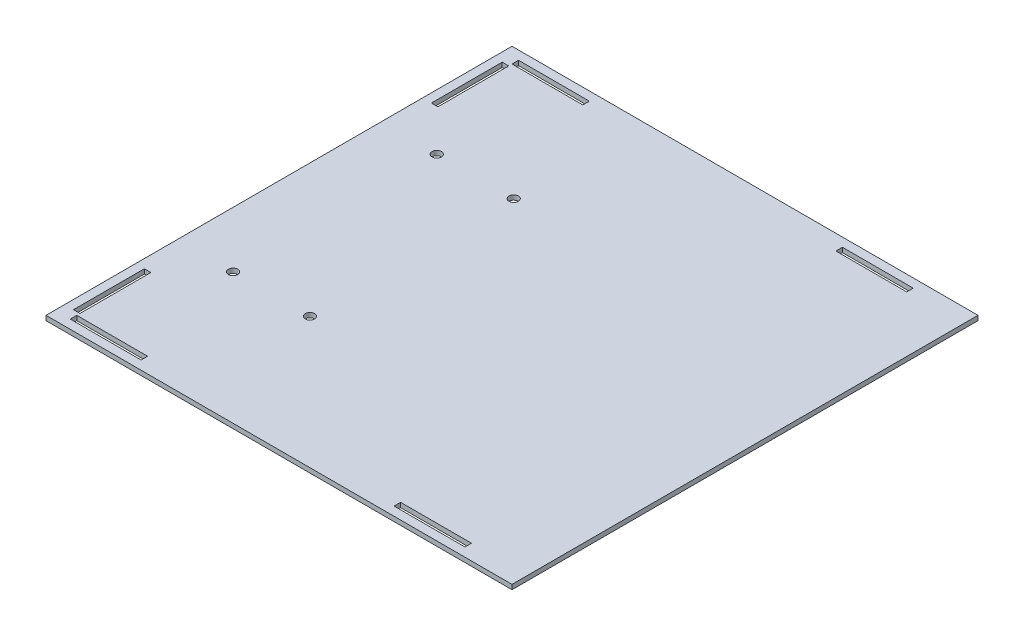
ISO-10303-21;
HEADER;
FILE_DESCRIPTION(('STEP AP214'),'2;1');
FILE_NAME('part.step','',(''),(''),'','','');
FILE_SCHEMA(('AUTOMOTIVE_DESIGN { 1 0 10303 214 1 1 1 1 }'));
ENDSEC;
DATA;
#1=APPLICATION_CONTEXT('core data for automotive mechanical design processes');
#2=APPLICATION_PROTOCOL_DEFINITION('international standard','automotive_design',2000,#1);
#3=PRODUCT_CONTEXT('',#1,'mechanical');
#4=PRODUCT('Part','Part','',(#3));
#5=PRODUCT_RELATED_PRODUCT_CATEGORY('part','',(#4));
#6=PRODUCT_DEFINITION_FORMATION('','',#4);
#7=PRODUCT_DEFINITION_CONTEXT('part definition',#1,'design');
#8=PRODUCT_DEFINITION('design','',#6,#7);
#9=PRODUCT_DEFINITION_SHAPE('','',#8);
#10=(LENGTH_UNIT() NAMED_UNIT(*) SI_UNIT(.MILLI.,.METRE.));
#11=(NAMED_UNIT(*) PLANE_ANGLE_UNIT() SI_UNIT($,.RADIAN.));
#12=(NAMED_UNIT(*) SI_UNIT($,.STERADIAN.) SOLID_ANGLE_UNIT());
#13=UNCERTAINTY_MEASURE_WITH_UNIT(LENGTH_MEASURE(1.E-05),#10,'distance_accuracy_value','');
#14=(GEOMETRIC_REPRESENTATION_CONTEXT(3) GLOBAL_UNCERTAINTY_ASSIGNED_CONTEXT((#13)) GLOBAL_UNIT_ASSIGNED_CONTEXT((#10,
#11,#12)) REPRESENTATION_CONTEXT('',''));
#15=CARTESIAN_POINT('',(0.,0.,0.));
#16=DIRECTION('',(0.,0.,1.));
#17=DIRECTION('',(1.,0.,0.));
#18=AXIS2_PLACEMENT_3D('',#15,#16,#17);
#19=CARTESIAN_POINT('',(0.,2.54,0.));
#20=DIRECTION('',(0.,1.,0.));
#21=DIRECTION('',(0.,0.,1.));
#22=AXIS2_PLACEMENT_3D('',#19,#20,#21);
#23=PLANE('',#22);
#24=CARTESIAN_POINT('',(30.48,2.54,119.0244));
#25=DIRECTION('',(0.,1.,0.));
#26=DIRECTION('',(0.,0.,1.));
#27=AXIS2_PLACEMENT_3D('',#24,#25,#26);
#28=CIRCLE('',#27,2.55269999999999);
#29=CARTESIAN_POINT('',(30.48,2.54,121.5771));
#30=VERTEX_POINT('',#29);
#31=EDGE_CURVE('E603',#30,#30,#28,.T.);
#32=ORIENTED_EDGE('',*,*,#31,.F.);
#33=EDGE_LOOP('',(#32));
#34=FACE_BOUND('',#33,.T.);
#35=CARTESIAN_POINT('',(72.39,2.54,119.0244));
#36=DIRECTION('',(0.,1.,0.));
#37=DIRECTION('',(0.,0.,1.));
#38=AXIS2_PLACEMENT_3D('',#35,#36,#37);
#39=CIRCLE('',#38,2.55269999999999);
#40=CARTESIAN_POINT('',(72.39,2.54,121.5771));
#41=VERTEX_POINT('',#40);
#42=EDGE_CURVE('E605',#41,#41,#39,.T.);
#43=ORIENTED_EDGE('',*,*,#42,.F.);
#44=EDGE_LOOP('',(#43));
#45=FACE_BOUND('',#44,.T.);
#46=CARTESIAN_POINT('',(30.48,2.54,7.9756));
#47=DIRECTION('',(0.,1.,0.));
#48=DIRECTION('',(0.,0.,1.));
#49=AXIS2_PLACEMENT_3D('',#46,#47,#48);
#50=CIRCLE('',#49,2.55269999999999);
#51=CARTESIAN_POINT('',(30.48,2.54,10.5283));
#52=VERTEX_POINT('',#51);
#53=EDGE_CURVE('E339',#52,#52,#50,.T.);
#54=ORIENTED_EDGE('',*,*,#53,.F.);
#55=EDGE_LOOP('',(#54));
#56=FACE_BOUND('',#55,.T.);
#57=CARTESIAN_POINT('',(72.39,2.54,7.9756));
#58=DIRECTION('',(0.,1.,0.));
#59=DIRECTION('',(0.,0.,1.));
#60=AXIS2_PLACEMENT_3D('',#57,#58,#59);
#61=CIRCLE('',#60,2.55269999999999);
#62=CARTESIAN_POINT('',(72.39,2.54,10.5283));
#63=VERTEX_POINT('',#62);
#64=EDGE_CURVE('E345',#63,#63,#61,.T.);
#65=ORIENTED_EDGE('',*,*,#64,.F.);
#66=EDGE_LOOP('',(#65));
#67=FACE_BOUND('',#66,.T.);
#68=DIRECTION('',(0.,0.,1.));
#69=VECTOR('',#68,1.);
#70=CARTESIAN_POINT('',(0.,2.54,-63.5));
#71=LINE('',#70,#69);
#72=CARTESIAN_POINT('',(0.,2.54,-63.5));
#73=VERTEX_POINT('',#72);
#74=CARTESIAN_POINT('',(0.,2.54,190.5));
#75=VERTEX_POINT('',#74);
#76=EDGE_CURVE('E439',#73,#75,#71,.T.);
#77=ORIENTED_EDGE('',*,*,#76,.T.);
#78=DIRECTION('',(-1.,0.,0.));
#79=VECTOR('',#78,1.);
#80=CARTESIAN_POINT('',(0.,2.54,190.5));
#81=LINE('',#80,#79);
#82=CARTESIAN_POINT('',(254.,2.54,190.5));
#83=VERTEX_POINT('',#82);
#84=EDGE_CURVE('E328',#83,#75,#81,.T.);
#85=ORIENTED_EDGE('',*,*,#84,.F.);
#86=DIRECTION('',(0.,0.,-1.));
#87=VECTOR('',#86,1.);
#88=CARTESIAN_POINT('',(254.,2.54,-63.5));
#89=LINE('',#88,#87);
#90=CARTESIAN_POINT('',(254.,2.54,-63.5));
#91=VERTEX_POINT('',#90);
#92=EDGE_CURVE('E441',#83,#91,#89,.T.);
#93=ORIENTED_EDGE('',*,*,#92,.T.);
#94=DIRECTION('',(-1.,0.,0.));
#95=VECTOR('',#94,1.);
#96=CARTESIAN_POINT('',(0.,2.54,-63.5));
#97=LINE('',#96,#95);
#98=EDGE_CURVE('E444',#91,#73,#97,.T.);
#99=ORIENTED_EDGE('',*,*,#98,.T.);
#100=EDGE_LOOP('',(#77,#85,#93,#99));
#101=FACE_BOUND('',#100,.T.);
#102=DIRECTION('',(1.,0.,0.));
#103=VECTOR('',#102,1.);
#104=CARTESIAN_POINT('',(8.382,2.54,-55.118));
#105=LINE('',#104,#103);
#106=CARTESIAN_POINT('',(8.382,2.54,-55.118));
#107=VERTEX_POINT('',#106);
#108=CARTESIAN_POINT('',(46.99,2.54,-55.118));
#109=VERTEX_POINT('',#108);
#110=EDGE_CURVE('E410',#107,#109,#105,.T.);
#111=ORIENTED_EDGE('',*,*,#110,.F.);
#112=DIRECTION('',(0.,0.,1.));
#113=VECTOR('',#112,1.);
#114=CARTESIAN_POINT('',(8.38199999999999,2.54,-58.674));
#115=LINE('',#114,#113);
#116=CARTESIAN_POINT('',(8.38199999999999,2.54,-58.674));
#117=VERTEX_POINT('',#116);
#118=EDGE_CURVE('E408',#117,#107,#115,.T.);
#119=ORIENTED_EDGE('',*,*,#118,.F.);
#120=DIRECTION('',(-1.,0.,0.));
#121=VECTOR('',#120,1.);
#122=CARTESIAN_POINT('',(8.38199999999999,2.54,-58.674));
#123=LINE('',#122,#121);
#124=CARTESIAN_POINT('',(46.99,2.54,-58.674));
#125=VERTEX_POINT('',#124);
#126=EDGE_CURVE('E416',#125,#117,#123,.T.);
#127=ORIENTED_EDGE('',*,*,#126,.F.);
#128=DIRECTION('',(0.,0.,-1.));
#129=VECTOR('',#128,1.);
#130=CARTESIAN_POINT('',(46.99,2.54,-58.674));
#131=LINE('',#130,#129);
#132=EDGE_CURVE('E413',#109,#125,#131,.T.);
#133=ORIENTED_EDGE('',*,*,#132,.F.);
#134=EDGE_LOOP('',(#111,#119,#127,#133));
#135=FACE_BOUND('',#134,.T.);
#136=DIRECTION('',(1.,0.,0.));
#137=VECTOR('',#136,1.);
#138=CARTESIAN_POINT('',(184.912,2.54,-55.118));
#139=LINE('',#138,#137);
#140=CARTESIAN_POINT('',(184.912,2.54,-55.118));
#141=VERTEX_POINT('',#140);
#142=CARTESIAN_POINT('',(223.52,2.54,-55.118));
#143=VERTEX_POINT('',#142);
#144=EDGE_CURVE('E379',#141,#143,#139,.T.);
#145=ORIENTED_EDGE('',*,*,#144,.F.);
#146=DIRECTION('',(0.,0.,1.));
#147=VECTOR('',#146,1.);
#148=CARTESIAN_POINT('',(184.912,2.54,-58.6740000000002));
#149=LINE('',#148,#147);
#150=CARTESIAN_POINT('',(184.912,2.54,-58.6740000000002));
#151=VERTEX_POINT('',#150);
#152=EDGE_CURVE('E377',#151,#141,#149,.T.);
#153=ORIENTED_EDGE('',*,*,#152,.F.);
#154=DIRECTION('',(-1.,0.,0.));
#155=VECTOR('',#154,1.);
#156=CARTESIAN_POINT('',(184.912,2.54,-58.6740000000002));
#157=LINE('',#156,#155);
#158=CARTESIAN_POINT('',(223.52,2.54,-58.6740000000002));
#159=VERTEX_POINT('',#158);
#160=EDGE_CURVE('E385',#159,#151,#157,.T.);
#161=ORIENTED_EDGE('',*,*,#160,.F.);
#162=DIRECTION('',(0.,0.,-1.));
#163=VECTOR('',#162,1.);
#164=CARTESIAN_POINT('',(223.52,2.54,-58.6740000000002));
#165=LINE('',#164,#163);
#166=EDGE_CURVE('E382',#143,#159,#165,.T.);
#167=ORIENTED_EDGE('',*,*,#166,.F.);
#168=EDGE_LOOP('',(#145,#153,#161,#167));
#169=FACE_BOUND('',#168,.T.);
#170=DIRECTION('',(1.,0.,0.));
#171=VECTOR('',#170,1.);
#172=CARTESIAN_POINT('',(4.82599999999999,2.54,-14.732));
#173=LINE('',#172,#171);
#174=CARTESIAN_POINT('',(4.82599999999999,2.54,-14.732));
#175=VERTEX_POINT('',#174);
#176=CARTESIAN_POINT('',(8.38199999999999,2.54,-14.732));
#177=VERTEX_POINT('',#176);
#178=EDGE_CURVE('E353',#175,#177,#173,.T.);
#179=ORIENTED_EDGE('',*,*,#178,.F.);
#180=DIRECTION('',(0.,0.,1.));
#181=VECTOR('',#180,1.);
#182=CARTESIAN_POINT('',(4.82599999999998,2.54,-53.34));
#183=LINE('',#182,#181);
#184=CARTESIAN_POINT('',(4.82599999999998,2.54,-53.34));
#185=VERTEX_POINT('',#184);
#186=EDGE_CURVE('E351',#185,#175,#183,.T.);
#187=ORIENTED_EDGE('',*,*,#186,.F.);
#188=DIRECTION('',(-1.,0.,0.));
#189=VECTOR('',#188,1.);
#190=CARTESIAN_POINT('',(4.82599999999998,2.54,-53.34));
#191=LINE('',#190,#189);
#192=CARTESIAN_POINT('',(8.38199999999998,2.54,-53.34));
#193=VERTEX_POINT('',#192);
#194=EDGE_CURVE('E358',#193,#185,#191,.T.);
#195=ORIENTED_EDGE('',*,*,#194,.F.);
#196=DIRECTION('',(0.,0.,-1.));
#197=VECTOR('',#196,1.);
#198=CARTESIAN_POINT('',(8.38199999999998,2.54,-53.34));
#199=LINE('',#198,#197);
#200=EDGE_CURVE('E356',#177,#193,#199,.T.);
#201=ORIENTED_EDGE('',*,*,#200,.F.);
#202=EDGE_LOOP('',(#179,#187,#195,#201));
#203=FACE_BOUND('',#202,.T.);
#204=DIRECTION('',(0.,0.,-1.));
#205=VECTOR('',#204,1.);
#206=CARTESIAN_POINT('',(4.82599999999998,2.54,180.34));
#207=LINE('',#206,#205);
#208=CARTESIAN_POINT('',(4.82599999999998,2.54,180.34));
#209=VERTEX_POINT('',#208);
#210=CARTESIAN_POINT('',(4.82599999999999,2.54,141.732));
#211=VERTEX_POINT('',#210);
#212=EDGE_CURVE('E234',#209,#211,#207,.T.);
#213=ORIENTED_EDGE('',*,*,#212,.T.);
#214=DIRECTION('',(1.,0.,0.));
#215=VECTOR('',#214,1.);
#216=CARTESIAN_POINT('',(4.82599999999999,2.54,141.732));
#217=LINE('',#216,#215);
#218=CARTESIAN_POINT('',(8.38199999999999,2.54,141.732));
#219=VERTEX_POINT('',#218);
#220=EDGE_CURVE('E246',#211,#219,#217,.T.);
#221=ORIENTED_EDGE('',*,*,#220,.T.);
#222=DIRECTION('',(0.,0.,1.));
#223=VECTOR('',#222,1.);
#224=CARTESIAN_POINT('',(8.38199999999998,2.54,180.34));
#225=LINE('',#224,#223);
#226=CARTESIAN_POINT('',(8.38199999999998,2.54,180.34));
#227=VERTEX_POINT('',#226);
#228=EDGE_CURVE('E244',#219,#227,#225,.T.);
#229=ORIENTED_EDGE('',*,*,#228,.T.);
#230=DIRECTION('',(-1.,0.,0.));
#231=VECTOR('',#230,1.);
#232=CARTESIAN_POINT('',(4.82599999999998,2.54,180.34));
#233=LINE('',#232,#231);
#234=EDGE_CURVE('E224',#227,#209,#233,.T.);
#235=ORIENTED_EDGE('',*,*,#234,.T.);
#236=EDGE_LOOP('',(#213,#221,#229,#235));
#237=FACE_BOUND('',#236,.T.);
#238=DIRECTION('',(0.,0.,-1.));
#239=VECTOR('',#238,1.);
#240=CARTESIAN_POINT('',(184.912,2.54,185.674));
#241=LINE('',#240,#239);
#242=CARTESIAN_POINT('',(184.912,2.54,185.674));
#243=VERTEX_POINT('',#242);
#244=CARTESIAN_POINT('',(184.912,2.54,182.118));
#245=VERTEX_POINT('',#244);
#246=EDGE_CURVE('E264',#243,#245,#241,.T.);
#247=ORIENTED_EDGE('',*,*,#246,.T.);
#248=DIRECTION('',(1.,0.,0.));
#249=VECTOR('',#248,1.);
#250=CARTESIAN_POINT('',(184.912,2.54,182.118));
#251=LINE('',#250,#249);
#252=CARTESIAN_POINT('',(223.52,2.54,182.118));
#253=VERTEX_POINT('',#252);
#254=EDGE_CURVE('E274',#245,#253,#251,.T.);
#255=ORIENTED_EDGE('',*,*,#254,.T.);
#256=DIRECTION('',(0.,0.,1.));
#257=VECTOR('',#256,1.);
#258=CARTESIAN_POINT('',(223.52,2.54,185.674));
#259=LINE('',#258,#257);
#260=CARTESIAN_POINT('',(223.52,2.54,185.674));
#261=VERTEX_POINT('',#260);
#262=EDGE_CURVE('E271',#253,#261,#259,.T.);
#263=ORIENTED_EDGE('',*,*,#262,.T.);
#264=DIRECTION('',(-1.,0.,0.));
#265=VECTOR('',#264,1.);
#266=CARTESIAN_POINT('',(184.912,2.54,185.674));
#267=LINE('',#266,#265);
#268=EDGE_CURVE('E267',#261,#243,#267,.T.);
#269=ORIENTED_EDGE('',*,*,#268,.T.);
#270=EDGE_LOOP('',(#247,#255,#263,#269));
#271=FACE_BOUND('',#270,.T.);
#272=DIRECTION('',(0.,0.,-1.));
#273=VECTOR('',#272,1.);
#274=CARTESIAN_POINT('',(8.38199999999999,2.54,185.674));
#275=LINE('',#274,#273);
#276=CARTESIAN_POINT('',(8.38199999999999,2.54,185.674));
#277=VERTEX_POINT('',#276);
#278=CARTESIAN_POINT('',(8.382,2.54,182.118));
#279=VERTEX_POINT('',#278);
#280=EDGE_CURVE('E296',#277,#279,#275,.T.);
#281=ORIENTED_EDGE('',*,*,#280,.T.);
#282=DIRECTION('',(1.,0.,0.));
#283=VECTOR('',#282,1.);
#284=CARTESIAN_POINT('',(8.382,2.54,182.118));
#285=LINE('',#284,#283);
#286=CARTESIAN_POINT('',(46.99,2.54,182.118));
#287=VERTEX_POINT('',#286);
#288=EDGE_CURVE('E306',#279,#287,#285,.T.);
#289=ORIENTED_EDGE('',*,*,#288,.T.);
#290=DIRECTION('',(0.,0.,1.));
#291=VECTOR('',#290,1.);
#292=CARTESIAN_POINT('',(46.99,2.54,185.674));
#293=LINE('',#292,#291);
#294=CARTESIAN_POINT('',(46.99,2.54,185.674));
#295=VERTEX_POINT('',#294);
#296=EDGE_CURVE('E303',#287,#295,#293,.T.);
#297=ORIENTED_EDGE('',*,*,#296,.T.);
#298=DIRECTION('',(-1.,0.,0.));
#299=VECTOR('',#298,1.);
#300=CARTESIAN_POINT('',(8.38199999999999,2.54,185.674));
#301=LINE('',#300,#299);
#302=EDGE_CURVE('E299',#295,#277,#301,.T.);
#303=ORIENTED_EDGE('',*,*,#302,.T.);
#304=EDGE_LOOP('',(#281,#289,#297,#303));
#305=FACE_BOUND('',#304,.T.);
#306=ADVANCED_FACE('F33',(#34,#45,#56,#67,#101,#135,#169,#203,#237,#271,#305),#23,.T.);
#307=CARTESIAN_POINT('',(0.,0.,0.));
#308=DIRECTION('',(0.,1.,0.));
#309=DIRECTION('',(0.,0.,1.));
#310=AXIS2_PLACEMENT_3D('',#307,#308,#309);
#311=PLANE('',#310);
#312=CARTESIAN_POINT('',(30.48,0.,119.0244));
#313=DIRECTION('',(0.,1.,0.));
#314=DIRECTION('',(0.,0.,1.));
#315=AXIS2_PLACEMENT_3D('',#312,#313,#314);
#316=CIRCLE('',#315,2.55269999999999);
#317=CARTESIAN_POINT('',(30.48,0.,121.5771));
#318=VERTEX_POINT('',#317);
#319=EDGE_CURVE('E601',#318,#318,#316,.T.);
#320=ORIENTED_EDGE('',*,*,#319,.T.);
#321=EDGE_LOOP('',(#320));
#322=FACE_BOUND('',#321,.T.);
#323=CARTESIAN_POINT('',(72.39,0.,119.0244));
#324=DIRECTION('',(0.,1.,0.));
#325=DIRECTION('',(0.,0.,1.));
#326=AXIS2_PLACEMENT_3D('',#323,#324,#325);
#327=CIRCLE('',#326,2.55269999999999);
#328=CARTESIAN_POINT('',(72.39,0.,121.5771));
#329=VERTEX_POINT('',#328);
#330=EDGE_CURVE('E253',#329,#329,#327,.T.);
#331=ORIENTED_EDGE('',*,*,#330,.T.);
#332=EDGE_LOOP('',(#331));
#333=FACE_BOUND('',#332,.T.);
#334=CARTESIAN_POINT('',(30.48,0.,7.9756));
#335=DIRECTION('',(0.,1.,0.));
#336=DIRECTION('',(0.,0.,1.));
#337=AXIS2_PLACEMENT_3D('',#334,#335,#336);
#338=CIRCLE('',#337,2.55269999999999);
#339=CARTESIAN_POINT('',(30.48,0.,10.5283));
#340=VERTEX_POINT('',#339);
#341=EDGE_CURVE('E342',#340,#340,#338,.T.);
#342=ORIENTED_EDGE('',*,*,#341,.T.);
#343=EDGE_LOOP('',(#342));
#344=FACE_BOUND('',#343,.T.);
#345=CARTESIAN_POINT('',(72.39,0.,7.9756));
#346=DIRECTION('',(0.,1.,0.));
#347=DIRECTION('',(0.,0.,1.));
#348=AXIS2_PLACEMENT_3D('',#345,#346,#347);
#349=CIRCLE('',#348,2.55269999999999);
#350=CARTESIAN_POINT('',(72.39,0.,10.5283));
#351=VERTEX_POINT('',#350);
#352=EDGE_CURVE('E348',#351,#351,#349,.T.);
#353=ORIENTED_EDGE('',*,*,#352,.T.);
#354=EDGE_LOOP('',(#353));
#355=FACE_BOUND('',#354,.T.);
#356=DIRECTION('',(0.,0.,1.));
#357=VECTOR('',#356,1.);
#358=CARTESIAN_POINT('',(184.912,0.,-58.6740000000002));
#359=LINE('',#358,#357);
#360=CARTESIAN_POINT('',(184.912,0.,-58.6740000000002));
#361=VERTEX_POINT('',#360);
#362=CARTESIAN_POINT('',(184.912,0.,-55.118));
#363=VERTEX_POINT('',#362);
#364=EDGE_CURVE('E376',#361,#363,#359,.T.);
#365=ORIENTED_EDGE('',*,*,#364,.T.);
#366=DIRECTION('',(1.,0.,0.));
#367=VECTOR('',#366,1.);
#368=CARTESIAN_POINT('',(184.912,0.,-55.118));
#369=LINE('',#368,#367);
#370=CARTESIAN_POINT('',(223.52,0.,-55.118));
#371=VERTEX_POINT('',#370);
#372=EDGE_CURVE('E390',#363,#371,#369,.T.);
#373=ORIENTED_EDGE('',*,*,#372,.T.);
#374=DIRECTION('',(0.,0.,-1.));
#375=VECTOR('',#374,1.);
#376=CARTESIAN_POINT('',(223.52,0.,-58.6740000000002));
#377=LINE('',#376,#375);
#378=CARTESIAN_POINT('',(223.52,0.,-58.6740000000002));
#379=VERTEX_POINT('',#378);
#380=EDGE_CURVE('E393',#371,#379,#377,.T.);
#381=ORIENTED_EDGE('',*,*,#380,.T.);
#382=DIRECTION('',(-1.,0.,0.));
#383=VECTOR('',#382,1.);
#384=CARTESIAN_POINT('',(184.912,0.,-58.6740000000002));
#385=LINE('',#384,#383);
#386=EDGE_CURVE('E380',#379,#361,#385,.T.);
#387=ORIENTED_EDGE('',*,*,#386,.T.);
#388=EDGE_LOOP('',(#365,#373,#381,#387));
#389=FACE_BOUND('',#388,.T.);
#390=DIRECTION('',(0.,0.,1.));
#391=VECTOR('',#390,1.);
#392=CARTESIAN_POINT('',(0.,0.,-63.5));
#393=LINE('',#392,#391);
#394=CARTESIAN_POINT('',(0.,0.,-63.5));
#395=VERTEX_POINT('',#394);
#396=CARTESIAN_POINT('',(0.,0.,190.5));
#397=VERTEX_POINT('',#396);
#398=EDGE_CURVE('E438',#395,#397,#393,.T.);
#399=ORIENTED_EDGE('',*,*,#398,.F.);
#400=DIRECTION('',(-1.,0.,0.));
#401=VECTOR('',#400,1.);
#402=CARTESIAN_POINT('',(0.,0.,-63.5));
#403=LINE('',#402,#401);
#404=CARTESIAN_POINT('',(254.,0.,-63.5));
#405=VERTEX_POINT('',#404);
#406=EDGE_CURVE('E442',#405,#395,#403,.T.);
#407=ORIENTED_EDGE('',*,*,#406,.F.);
#408=DIRECTION('',(0.,0.,-1.));
#409=VECTOR('',#408,1.);
#410=CARTESIAN_POINT('',(254.,0.,-63.5));
#411=LINE('',#410,#409);
#412=CARTESIAN_POINT('',(254.,0.,190.5));
#413=VERTEX_POINT('',#412);
#414=EDGE_CURVE('E447',#413,#405,#411,.T.);
#415=ORIENTED_EDGE('',*,*,#414,.F.);
#416=DIRECTION('',(-1.,0.,0.));
#417=VECTOR('',#416,1.);
#418=CARTESIAN_POINT('',(0.,0.,190.5));
#419=LINE('',#418,#417);
#420=EDGE_CURVE('E327',#413,#397,#419,.T.);
#421=ORIENTED_EDGE('',*,*,#420,.T.);
#422=EDGE_LOOP('',(#399,#407,#415,#421));
#423=FACE_BOUND('',#422,.T.);
#424=DIRECTION('',(0.,0.,1.));
#425=VECTOR('',#424,1.);
#426=CARTESIAN_POINT('',(8.38199999999999,0.,-58.674));
#427=LINE('',#426,#425);
#428=CARTESIAN_POINT('',(8.38199999999999,0.,-58.674));
#429=VERTEX_POINT('',#428);
#430=CARTESIAN_POINT('',(8.382,0.,-55.118));
#431=VERTEX_POINT('',#430);
#432=EDGE_CURVE('E407',#429,#431,#427,.T.);
#433=ORIENTED_EDGE('',*,*,#432,.T.);
#434=DIRECTION('',(1.,0.,0.));
#435=VECTOR('',#434,1.);
#436=CARTESIAN_POINT('',(8.382,0.,-55.118));
#437=LINE('',#436,#435);
#438=CARTESIAN_POINT('',(46.99,0.,-55.118));
#439=VERTEX_POINT('',#438);
#440=EDGE_CURVE('E421',#431,#439,#437,.T.);
#441=ORIENTED_EDGE('',*,*,#440,.T.);
#442=DIRECTION('',(0.,0.,-1.));
#443=VECTOR('',#442,1.);
#444=CARTESIAN_POINT('',(46.99,0.,-58.674));
#445=LINE('',#444,#443);
#446=CARTESIAN_POINT('',(46.99,0.,-58.674));
#447=VERTEX_POINT('',#446);
#448=EDGE_CURVE('E424',#439,#447,#445,.T.);
#449=ORIENTED_EDGE('',*,*,#448,.T.);
#450=DIRECTION('',(-1.,0.,0.));
#451=VECTOR('',#450,1.);
#452=CARTESIAN_POINT('',(8.38199999999999,0.,-58.674));
#453=LINE('',#452,#451);
#454=EDGE_CURVE('E411',#447,#429,#453,.T.);
#455=ORIENTED_EDGE('',*,*,#454,.T.);
#456=EDGE_LOOP('',(#433,#441,#449,#455));
#457=FACE_BOUND('',#456,.T.);
#458=DIRECTION('',(0.,0.,1.));
#459=VECTOR('',#458,1.);
#460=CARTESIAN_POINT('',(4.82599999999998,0.,-53.34));
#461=LINE('',#460,#459);
#462=CARTESIAN_POINT('',(4.82599999999998,0.,-53.34));
#463=VERTEX_POINT('',#462);
#464=CARTESIAN_POINT('',(4.82599999999999,0.,-14.732));
#465=VERTEX_POINT('',#464);
#466=EDGE_CURVE('E56',#463,#465,#461,.T.);
#467=ORIENTED_EDGE('',*,*,#466,.T.);
#468=DIRECTION('',(1.,0.,0.));
#469=VECTOR('',#468,1.);
#470=CARTESIAN_POINT('',(4.82599999999999,0.,-14.732));
#471=LINE('',#470,#469);
#472=CARTESIAN_POINT('',(8.38199999999999,0.,-14.732));
#473=VERTEX_POINT('',#472);
#474=EDGE_CURVE('E362',#465,#473,#471,.T.);
#475=ORIENTED_EDGE('',*,*,#474,.T.);
#476=DIRECTION('',(0.,0.,-1.));
#477=VECTOR('',#476,1.);
#478=CARTESIAN_POINT('',(8.38199999999998,0.,-53.34));
#479=LINE('',#478,#477);
#480=CARTESIAN_POINT('',(8.38199999999998,0.,-53.34));
#481=VERTEX_POINT('',#480);
#482=EDGE_CURVE('E365',#473,#481,#479,.T.);
#483=ORIENTED_EDGE('',*,*,#482,.T.);
#484=DIRECTION('',(-1.,0.,0.));
#485=VECTOR('',#484,1.);
#486=CARTESIAN_POINT('',(4.82599999999998,0.,-53.34));
#487=LINE('',#486,#485);
#488=EDGE_CURVE('E354',#481,#463,#487,.T.);
#489=ORIENTED_EDGE('',*,*,#488,.T.);
#490=EDGE_LOOP('',(#467,#475,#483,#489));
#491=FACE_BOUND('',#490,.T.);
#492=DIRECTION('',(1.,0.,0.));
#493=VECTOR('',#492,1.);
#494=CARTESIAN_POINT('',(4.82599999999999,0.,141.732));
#495=LINE('',#494,#493);
#496=CARTESIAN_POINT('',(4.82599999999999,0.,141.732));
#497=VERTEX_POINT('',#496);
#498=CARTESIAN_POINT('',(8.38199999999999,0.,141.732));
#499=VERTEX_POINT('',#498);
#500=EDGE_CURVE('E241',#497,#499,#495,.T.);
#501=ORIENTED_EDGE('',*,*,#500,.F.);
#502=DIRECTION('',(0.,0.,-1.));
#503=VECTOR('',#502,1.);
#504=CARTESIAN_POINT('',(4.82599999999998,0.,180.34));
#505=LINE('',#504,#503);
#506=CARTESIAN_POINT('',(4.82599999999998,0.,180.34));
#507=VERTEX_POINT('',#506);
#508=EDGE_CURVE('E251',#507,#497,#505,.T.);
#509=ORIENTED_EDGE('',*,*,#508,.F.);
#510=DIRECTION('',(-1.,0.,0.));
#511=VECTOR('',#510,1.);
#512=CARTESIAN_POINT('',(4.82599999999998,0.,180.34));
#513=LINE('',#512,#511);
#514=CARTESIAN_POINT('',(8.38199999999998,0.,180.34));
#515=VERTEX_POINT('',#514);
#516=EDGE_CURVE('E227',#515,#507,#513,.T.);
#517=ORIENTED_EDGE('',*,*,#516,.F.);
#518=DIRECTION('',(0.,0.,1.));
#519=VECTOR('',#518,1.);
#520=CARTESIAN_POINT('',(8.38199999999998,0.,180.34));
#521=LINE('',#520,#519);
#522=EDGE_CURVE('E255',#499,#515,#521,.T.);
#523=ORIENTED_EDGE('',*,*,#522,.F.);
#524=EDGE_LOOP('',(#501,#509,#517,#523));
#525=FACE_BOUND('',#524,.T.);
#526=DIRECTION('',(1.,0.,0.));
#527=VECTOR('',#526,1.);
#528=CARTESIAN_POINT('',(184.912,0.,182.118));
#529=LINE('',#528,#527);
#530=CARTESIAN_POINT('',(184.912,0.,182.118));
#531=VERTEX_POINT('',#530);
#532=CARTESIAN_POINT('',(223.52,0.,182.118));
#533=VERTEX_POINT('',#532);
#534=EDGE_CURVE('E268',#531,#533,#529,.T.);
#535=ORIENTED_EDGE('',*,*,#534,.F.);
#536=DIRECTION('',(0.,0.,-1.));
#537=VECTOR('',#536,1.);
#538=CARTESIAN_POINT('',(184.912,0.,185.674));
#539=LINE('',#538,#537);
#540=CARTESIAN_POINT('',(184.912,0.,185.674));
#541=VERTEX_POINT('',#540);
#542=EDGE_CURVE('E230',#541,#531,#539,.T.);
#543=ORIENTED_EDGE('',*,*,#542,.F.);
#544=DIRECTION('',(-1.,0.,0.));
#545=VECTOR('',#544,1.);
#546=CARTESIAN_POINT('',(184.912,0.,185.674));
#547=LINE('',#546,#545);
#548=CARTESIAN_POINT('',(223.52,0.,185.674));
#549=VERTEX_POINT('',#548);
#550=EDGE_CURVE('E279',#549,#541,#547,.T.);
#551=ORIENTED_EDGE('',*,*,#550,.F.);
#552=DIRECTION('',(0.,0.,1.));
#553=VECTOR('',#552,1.);
#554=CARTESIAN_POINT('',(223.52,0.,185.674));
#555=LINE('',#554,#553);
#556=EDGE_CURVE('E282',#533,#549,#555,.T.);
#557=ORIENTED_EDGE('',*,*,#556,.F.);
#558=EDGE_LOOP('',(#535,#543,#551,#557));
#559=FACE_BOUND('',#558,.T.);
#560=DIRECTION('',(1.,0.,0.));
#561=VECTOR('',#560,1.);
#562=CARTESIAN_POINT('',(8.382,0.,182.118));
#563=LINE('',#562,#561);
#564=CARTESIAN_POINT('',(8.382,0.,182.118));
#565=VERTEX_POINT('',#564);
#566=CARTESIAN_POINT('',(46.99,0.,182.118));
#567=VERTEX_POINT('',#566);
#568=EDGE_CURVE('E300',#565,#567,#563,.T.);
#569=ORIENTED_EDGE('',*,*,#568,.F.);
#570=DIRECTION('',(0.,0.,-1.));
#571=VECTOR('',#570,1.);
#572=CARTESIAN_POINT('',(8.38199999999999,0.,185.674));
#573=LINE('',#572,#571);
#574=CARTESIAN_POINT('',(8.38199999999999,0.,185.674));
#575=VERTEX_POINT('',#574);
#576=EDGE_CURVE('E295',#575,#565,#573,.T.);
#577=ORIENTED_EDGE('',*,*,#576,.F.);
#578=DIRECTION('',(-1.,0.,0.));
#579=VECTOR('',#578,1.);
#580=CARTESIAN_POINT('',(8.38199999999999,0.,185.674));
#581=LINE('',#580,#579);
#582=CARTESIAN_POINT('',(46.99,0.,185.674));
#583=VERTEX_POINT('',#582);
#584=EDGE_CURVE('E311',#583,#575,#581,.T.);
#585=ORIENTED_EDGE('',*,*,#584,.F.);
#586=DIRECTION('',(0.,0.,1.));
#587=VECTOR('',#586,1.);
#588=CARTESIAN_POINT('',(46.99,0.,185.674));
#589=LINE('',#588,#587);
#590=EDGE_CURVE('E314',#567,#583,#589,.T.);
#591=ORIENTED_EDGE('',*,*,#590,.F.);
#592=EDGE_LOOP('',(#569,#577,#585,#591));
#593=FACE_BOUND('',#592,.T.);
#594=ADVANCED_FACE('F459',(#322,#333,#344,#355,#389,#423,#457,#491,#525,#559,#593),#311,.F.);
#595=CARTESIAN_POINT('',(0.,2.54,-63.5));
#596=DIRECTION('',(1.,0.,0.));
#597=DIRECTION('',(0.,0.,-1.));
#598=AXIS2_PLACEMENT_3D('',#595,#596,#597);
#599=PLANE('',#598);
#600=ORIENTED_EDGE('',*,*,#398,.T.);
#601=DIRECTION('',(0.,-1.,0.));
#602=VECTOR('',#601,1.);
#603=CARTESIAN_POINT('',(0.,2.54,190.5));
#604=LINE('',#603,#602);
#605=EDGE_CURVE('E336',#75,#397,#604,.T.);
#606=ORIENTED_EDGE('',*,*,#605,.F.);
#607=ORIENTED_EDGE('',*,*,#76,.F.);
#608=DIRECTION('',(0.,-1.,0.));
#609=VECTOR('',#608,1.);
#610=CARTESIAN_POINT('',(0.,2.54,-63.5));
#611=LINE('',#610,#609);
#612=EDGE_CURVE('E41',#73,#395,#611,.T.);
#613=ORIENTED_EDGE('',*,*,#612,.T.);
#614=EDGE_LOOP('',(#600,#606,#607,#613));
#615=FACE_BOUND('',#614,.T.);
#616=ADVANCED_FACE('F35',(#615),#599,.F.);
#617=CARTESIAN_POINT('',(254.,2.54,-63.5));
#618=DIRECTION('',(-1.,0.,0.));
#619=DIRECTION('',(0.,0.,1.));
#620=AXIS2_PLACEMENT_3D('',#617,#618,#619);
#621=PLANE('',#620);
#622=ORIENTED_EDGE('',*,*,#414,.T.);
#623=DIRECTION('',(0.,-1.,0.));
#624=VECTOR('',#623,1.);
#625=CARTESIAN_POINT('',(254.,2.54,-63.5));
#626=LINE('',#625,#624);
#627=EDGE_CURVE('E11',#91,#405,#626,.T.);
#628=ORIENTED_EDGE('',*,*,#627,.F.);
#629=ORIENTED_EDGE('',*,*,#92,.F.);
#630=DIRECTION('',(0.,-1.,0.));
#631=VECTOR('',#630,1.);
#632=CARTESIAN_POINT('',(254.,2.54,190.5));
#633=LINE('',#632,#631);
#634=EDGE_CURVE('E331',#83,#413,#633,.T.);
#635=ORIENTED_EDGE('',*,*,#634,.T.);
#636=EDGE_LOOP('',(#622,#628,#629,#635));
#637=FACE_BOUND('',#636,.T.);
#638=ADVANCED_FACE('F471',(#637),#621,.F.);
#639=CARTESIAN_POINT('',(0.,2.54,-63.5));
#640=DIRECTION('',(0.,0.,1.));
#641=DIRECTION('',(1.,0.,0.));
#642=AXIS2_PLACEMENT_3D('',#639,#640,#641);
#643=PLANE('',#642);
#644=ORIENTED_EDGE('',*,*,#406,.T.);
#645=ORIENTED_EDGE('',*,*,#612,.F.);
#646=ORIENTED_EDGE('',*,*,#98,.F.);
#647=ORIENTED_EDGE('',*,*,#627,.T.);
#648=EDGE_LOOP('',(#644,#645,#646,#647));
#649=FACE_BOUND('',#648,.T.);
#650=ADVANCED_FACE('F469',(#649),#643,.F.);
#651=CARTESIAN_POINT('',(8.38199999999999,2.54,-58.674));
#652=DIRECTION('',(1.,0.,0.));
#653=DIRECTION('',(0.,0.,-1.));
#654=AXIS2_PLACEMENT_3D('',#651,#652,#653);
#655=PLANE('',#654);
#656=ORIENTED_EDGE('',*,*,#432,.F.);
#657=DIRECTION('',(0.,-1.,0.));
#658=VECTOR('',#657,1.);
#659=CARTESIAN_POINT('',(8.38199999999999,2.54,-58.674));
#660=LINE('',#659,#658);
#661=EDGE_CURVE('E418',#117,#429,#660,.T.);
#662=ORIENTED_EDGE('',*,*,#661,.F.);
#663=ORIENTED_EDGE('',*,*,#118,.T.);
#664=DIRECTION('',(0.,-1.,0.));
#665=VECTOR('',#664,1.);
#666=CARTESIAN_POINT('',(8.382,2.54,-55.118));
#667=LINE('',#666,#665);
#668=EDGE_CURVE('E435',#107,#431,#667,.T.);
#669=ORIENTED_EDGE('',*,*,#668,.T.);
#670=EDGE_LOOP('',(#656,#662,#663,#669));
#671=FACE_BOUND('',#670,.T.);
#672=ADVANCED_FACE('F477',(#671),#655,.T.);
#673=CARTESIAN_POINT('',(8.382,2.54,-55.118));
#674=DIRECTION('',(0.,0.,-1.));
#675=DIRECTION('',(-1.,0.,0.));
#676=AXIS2_PLACEMENT_3D('',#673,#674,#675);
#677=PLANE('',#676);
#678=ORIENTED_EDGE('',*,*,#440,.F.);
#679=ORIENTED_EDGE('',*,*,#668,.F.);
#680=ORIENTED_EDGE('',*,*,#110,.T.);
#681=DIRECTION('',(0.,-1.,0.));
#682=VECTOR('',#681,1.);
#683=CARTESIAN_POINT('',(46.99,2.54,-55.118));
#684=LINE('',#683,#682);
#685=EDGE_CURVE('E433',#109,#439,#684,.T.);
#686=ORIENTED_EDGE('',*,*,#685,.T.);
#687=EDGE_LOOP('',(#678,#679,#680,#686));
#688=FACE_BOUND('',#687,.T.);
#689=ADVANCED_FACE('F492',(#688),#677,.T.);
#690=CARTESIAN_POINT('',(46.99,2.54,-58.674));
#691=DIRECTION('',(-1.,0.,0.));
#692=DIRECTION('',(0.,0.,1.));
#693=AXIS2_PLACEMENT_3D('',#690,#691,#692);
#694=PLANE('',#693);
#695=ORIENTED_EDGE('',*,*,#448,.F.);
#696=ORIENTED_EDGE('',*,*,#685,.F.);
#697=ORIENTED_EDGE('',*,*,#132,.T.);
#698=DIRECTION('',(0.,-1.,0.));
#699=VECTOR('',#698,1.);
#700=CARTESIAN_POINT('',(46.99,2.54,-58.674));
#701=LINE('',#700,#699);
#702=EDGE_CURVE('E431',#125,#447,#701,.T.);
#703=ORIENTED_EDGE('',*,*,#702,.T.);
#704=EDGE_LOOP('',(#695,#696,#697,#703));
#705=FACE_BOUND('',#704,.T.);
#706=ADVANCED_FACE('F496',(#705),#694,.T.);
#707=CARTESIAN_POINT('',(8.38199999999999,2.54,-58.674));
#708=DIRECTION('',(0.,0.,1.));
#709=DIRECTION('',(1.,0.,0.));
#710=AXIS2_PLACEMENT_3D('',#707,#708,#709);
#711=PLANE('',#710);
#712=ORIENTED_EDGE('',*,*,#454,.F.);
#713=ORIENTED_EDGE('',*,*,#702,.F.);
#714=ORIENTED_EDGE('',*,*,#126,.T.);
#715=ORIENTED_EDGE('',*,*,#661,.T.);
#716=EDGE_LOOP('',(#712,#713,#714,#715));
#717=FACE_BOUND('',#716,.T.);
#718=ADVANCED_FACE('F500',(#717),#711,.T.);
#719=CARTESIAN_POINT('',(184.912,2.54,-58.6740000000002));
#720=DIRECTION('',(1.,0.,0.));
#721=DIRECTION('',(0.,0.,-1.));
#722=AXIS2_PLACEMENT_3D('',#719,#720,#721);
#723=PLANE('',#722);
#724=ORIENTED_EDGE('',*,*,#364,.F.);
#725=DIRECTION('',(0.,-1.,0.));
#726=VECTOR('',#725,1.);
#727=CARTESIAN_POINT('',(184.912,2.54,-58.6740000000002));
#728=LINE('',#727,#726);
#729=EDGE_CURVE('E387',#151,#361,#728,.T.);
#730=ORIENTED_EDGE('',*,*,#729,.F.);
#731=ORIENTED_EDGE('',*,*,#152,.T.);
#732=DIRECTION('',(0.,-1.,0.));
#733=VECTOR('',#732,1.);
#734=CARTESIAN_POINT('',(184.912,2.54,-55.118));
#735=LINE('',#734,#733);
#736=EDGE_CURVE('E404',#141,#363,#735,.T.);
#737=ORIENTED_EDGE('',*,*,#736,.T.);
#738=EDGE_LOOP('',(#724,#730,#731,#737));
#739=FACE_BOUND('',#738,.T.);
#740=ADVANCED_FACE('F504',(#739),#723,.T.);
#741=CARTESIAN_POINT('',(184.912,2.54,-55.118));
#742=DIRECTION('',(0.,0.,-1.));
#743=DIRECTION('',(-1.,0.,0.));
#744=AXIS2_PLACEMENT_3D('',#741,#742,#743);
#745=PLANE('',#744);
#746=ORIENTED_EDGE('',*,*,#372,.F.);
#747=ORIENTED_EDGE('',*,*,#736,.F.);
#748=ORIENTED_EDGE('',*,*,#144,.T.);
#749=DIRECTION('',(0.,-1.,0.));
#750=VECTOR('',#749,1.);
#751=CARTESIAN_POINT('',(223.52,2.54,-55.118));
#752=LINE('',#751,#750);
#753=EDGE_CURVE('E402',#143,#371,#752,.T.);
#754=ORIENTED_EDGE('',*,*,#753,.T.);
#755=EDGE_LOOP('',(#746,#747,#748,#754));
#756=FACE_BOUND('',#755,.T.);
#757=ADVANCED_FACE('F508',(#756),#745,.T.);
#758=CARTESIAN_POINT('',(223.52,2.54,-58.6740000000002));
#759=DIRECTION('',(-1.,0.,0.));
#760=DIRECTION('',(0.,0.,1.));
#761=AXIS2_PLACEMENT_3D('',#758,#759,#760);
#762=PLANE('',#761);
#763=ORIENTED_EDGE('',*,*,#380,.F.);
#764=ORIENTED_EDGE('',*,*,#753,.F.);
#765=ORIENTED_EDGE('',*,*,#166,.T.);
#766=DIRECTION('',(0.,-1.,0.));
#767=VECTOR('',#766,1.);
#768=CARTESIAN_POINT('',(223.52,2.54,-58.6740000000002));
#769=LINE('',#768,#767);
#770=EDGE_CURVE('E400',#159,#379,#769,.T.);
#771=ORIENTED_EDGE('',*,*,#770,.T.);
#772=EDGE_LOOP('',(#763,#764,#765,#771));
#773=FACE_BOUND('',#772,.T.);
#774=ADVANCED_FACE('F512',(#773),#762,.T.);
#775=CARTESIAN_POINT('',(184.912,2.54,-58.6740000000002));
#776=DIRECTION('',(0.,0.,1.));
#777=DIRECTION('',(1.,0.,0.));
#778=AXIS2_PLACEMENT_3D('',#775,#776,#777);
#779=PLANE('',#778);
#780=ORIENTED_EDGE('',*,*,#386,.F.);
#781=ORIENTED_EDGE('',*,*,#770,.F.);
#782=ORIENTED_EDGE('',*,*,#160,.T.);
#783=ORIENTED_EDGE('',*,*,#729,.T.);
#784=EDGE_LOOP('',(#780,#781,#782,#783));
#785=FACE_BOUND('',#784,.T.);
#786=ADVANCED_FACE('F516',(#785),#779,.T.);
#787=CARTESIAN_POINT('',(4.82599999999998,2.54,-53.34));
#788=DIRECTION('',(1.,0.,0.));
#789=DIRECTION('',(0.,0.,-1.));
#790=AXIS2_PLACEMENT_3D('',#787,#788,#789);
#791=PLANE('',#790);
#792=ORIENTED_EDGE('',*,*,#466,.F.);
#793=DIRECTION('',(0.,-1.,0.));
#794=VECTOR('',#793,1.);
#795=CARTESIAN_POINT('',(4.82599999999998,2.54,-53.34));
#796=LINE('',#795,#794);
#797=EDGE_CURVE('E360',#185,#463,#796,.T.);
#798=ORIENTED_EDGE('',*,*,#797,.F.);
#799=ORIENTED_EDGE('',*,*,#186,.T.);
#800=DIRECTION('',(0.,-1.,0.));
#801=VECTOR('',#800,1.);
#802=CARTESIAN_POINT('',(4.82599999999999,2.54,-14.732));
#803=LINE('',#802,#801);
#804=EDGE_CURVE('E374',#175,#465,#803,.T.);
#805=ORIENTED_EDGE('',*,*,#804,.T.);
#806=EDGE_LOOP('',(#792,#798,#799,#805));
#807=FACE_BOUND('',#806,.T.);
#808=ADVANCED_FACE('F520',(#807),#791,.T.);
#809=CARTESIAN_POINT('',(4.82599999999999,2.54,-14.732));
#810=DIRECTION('',(0.,0.,-1.));
#811=DIRECTION('',(-1.,0.,0.));
#812=AXIS2_PLACEMENT_3D('',#809,#810,#811);
#813=PLANE('',#812);
#814=ORIENTED_EDGE('',*,*,#474,.F.);
#815=ORIENTED_EDGE('',*,*,#804,.F.);
#816=ORIENTED_EDGE('',*,*,#178,.T.);
#817=DIRECTION('',(0.,-1.,0.));
#818=VECTOR('',#817,1.);
#819=CARTESIAN_POINT('',(8.38199999999999,2.54,-14.732));
#820=LINE('',#819,#818);
#821=EDGE_CURVE('E372',#177,#473,#820,.T.);
#822=ORIENTED_EDGE('',*,*,#821,.T.);
#823=EDGE_LOOP('',(#814,#815,#816,#822));
#824=FACE_BOUND('',#823,.T.);
#825=ADVANCED_FACE('F524',(#824),#813,.T.);
#826=CARTESIAN_POINT('',(8.38199999999998,2.54,-53.34));
#827=DIRECTION('',(-1.,0.,0.));
#828=DIRECTION('',(0.,0.,1.));
#829=AXIS2_PLACEMENT_3D('',#826,#827,#828);
#830=PLANE('',#829);
#831=ORIENTED_EDGE('',*,*,#482,.F.);
#832=ORIENTED_EDGE('',*,*,#821,.F.);
#833=ORIENTED_EDGE('',*,*,#200,.T.);
#834=DIRECTION('',(0.,-1.,0.));
#835=VECTOR('',#834,1.);
#836=CARTESIAN_POINT('',(8.38199999999998,2.54,-53.34));
#837=LINE('',#836,#835);
#838=EDGE_CURVE('E48',#193,#481,#837,.T.);
#839=ORIENTED_EDGE('',*,*,#838,.T.);
#840=EDGE_LOOP('',(#831,#832,#833,#839));
#841=FACE_BOUND('',#840,.T.);
#842=ADVANCED_FACE('F527',(#841),#830,.T.);
#843=CARTESIAN_POINT('',(4.82599999999998,2.54,-53.34));
#844=DIRECTION('',(0.,0.,1.));
#845=DIRECTION('',(1.,0.,0.));
#846=AXIS2_PLACEMENT_3D('',#843,#844,#845);
#847=PLANE('',#846);
#848=ORIENTED_EDGE('',*,*,#488,.F.);
#849=ORIENTED_EDGE('',*,*,#838,.F.);
#850=ORIENTED_EDGE('',*,*,#194,.T.);
#851=ORIENTED_EDGE('',*,*,#797,.T.);
#852=EDGE_LOOP('',(#848,#849,#850,#851));
#853=FACE_BOUND('',#852,.T.);
#854=ADVANCED_FACE('F531',(#853),#847,.T.);
#855=CARTESIAN_POINT('',(72.39,2.54,7.9756));
#856=DIRECTION('',(0.,1.,0.));
#857=DIRECTION('',(0.,0.,1.));
#858=AXIS2_PLACEMENT_3D('',#855,#856,#857);
#859=CYLINDRICAL_SURFACE('',#858,2.55269999999999);
#860=ORIENTED_EDGE('',*,*,#352,.F.);
#861=EDGE_LOOP('',(#860));
#862=FACE_BOUND('',#861,.T.);
#863=ORIENTED_EDGE('',*,*,#64,.T.);
#864=EDGE_LOOP('',(#863));
#865=FACE_BOUND('',#864,.T.);
#866=ADVANCED_FACE('F535',(#862,#865),#859,.F.);
#867=CARTESIAN_POINT('',(30.48,2.54,7.9756));
#868=DIRECTION('',(0.,1.,0.));
#869=DIRECTION('',(0.,0.,1.));
#870=AXIS2_PLACEMENT_3D('',#867,#868,#869);
#871=CYLINDRICAL_SURFACE('',#870,2.55269999999999);
#872=ORIENTED_EDGE('',*,*,#341,.F.);
#873=EDGE_LOOP('',(#872));
#874=FACE_BOUND('',#873,.T.);
#875=ORIENTED_EDGE('',*,*,#53,.T.);
#876=EDGE_LOOP('',(#875));
#877=FACE_BOUND('',#876,.T.);
#878=ADVANCED_FACE('F538',(#874,#877),#871,.F.);
#879=CARTESIAN_POINT('',(0.,2.54,190.5));
#880=DIRECTION('',(0.,0.,1.));
#881=DIRECTION('',(1.,0.,0.));
#882=AXIS2_PLACEMENT_3D('',#879,#880,#881);
#883=PLANE('',#882);
#884=ORIENTED_EDGE('',*,*,#420,.F.);
#885=ORIENTED_EDGE('',*,*,#634,.F.);
#886=ORIENTED_EDGE('',*,*,#84,.T.);
#887=ORIENTED_EDGE('',*,*,#605,.T.);
#888=EDGE_LOOP('',(#884,#885,#886,#887));
#889=FACE_BOUND('',#888,.T.);
#890=ADVANCED_FACE('F464',(#889),#883,.T.);
#891=CARTESIAN_POINT('',(8.38199999999999,2.54,185.674));
#892=DIRECTION('',(-1.,0.,0.));
#893=DIRECTION('',(0.,0.,1.));
#894=AXIS2_PLACEMENT_3D('',#891,#892,#893);
#895=PLANE('',#894);
#896=ORIENTED_EDGE('',*,*,#576,.T.);
#897=DIRECTION('',(0.,-1.,0.));
#898=VECTOR('',#897,1.);
#899=CARTESIAN_POINT('',(8.382,2.54,182.118));
#900=LINE('',#899,#898);
#901=EDGE_CURVE('E309',#279,#565,#900,.T.);
#902=ORIENTED_EDGE('',*,*,#901,.F.);
#903=ORIENTED_EDGE('',*,*,#280,.F.);
#904=DIRECTION('',(0.,-1.,0.));
#905=VECTOR('',#904,1.);
#906=CARTESIAN_POINT('',(8.38199999999999,2.54,185.674));
#907=LINE('',#906,#905);
#908=EDGE_CURVE('E325',#277,#575,#907,.T.);
#909=ORIENTED_EDGE('',*,*,#908,.T.);
#910=EDGE_LOOP('',(#896,#902,#903,#909));
#911=FACE_BOUND('',#910,.T.);
#912=ADVANCED_FACE('F545',(#911),#895,.F.);
#913=CARTESIAN_POINT('',(8.38199999999999,2.54,185.674));
#914=DIRECTION('',(0.,0.,1.));
#915=DIRECTION('',(1.,0.,0.));
#916=AXIS2_PLACEMENT_3D('',#913,#914,#915);
#917=PLANE('',#916);
#918=ORIENTED_EDGE('',*,*,#584,.T.);
#919=ORIENTED_EDGE('',*,*,#908,.F.);
#920=ORIENTED_EDGE('',*,*,#302,.F.);
#921=DIRECTION('',(0.,-1.,0.));
#922=VECTOR('',#921,1.);
#923=CARTESIAN_POINT('',(46.99,2.54,185.674));
#924=LINE('',#923,#922);
#925=EDGE_CURVE('E323',#295,#583,#924,.T.);
#926=ORIENTED_EDGE('',*,*,#925,.T.);
#927=EDGE_LOOP('',(#918,#919,#920,#926));
#928=FACE_BOUND('',#927,.T.);
#929=ADVANCED_FACE('F548',(#928),#917,.F.);
#930=CARTESIAN_POINT('',(46.99,2.54,185.674));
#931=DIRECTION('',(1.,0.,0.));
#932=DIRECTION('',(0.,0.,-1.));
#933=AXIS2_PLACEMENT_3D('',#930,#931,#932);
#934=PLANE('',#933);
#935=ORIENTED_EDGE('',*,*,#590,.T.);
#936=ORIENTED_EDGE('',*,*,#925,.F.);
#937=ORIENTED_EDGE('',*,*,#296,.F.);
#938=DIRECTION('',(0.,-1.,0.));
#939=VECTOR('',#938,1.);
#940=CARTESIAN_POINT('',(46.99,2.54,182.118));
#941=LINE('',#940,#939);
#942=EDGE_CURVE('E321',#287,#567,#941,.T.);
#943=ORIENTED_EDGE('',*,*,#942,.T.);
#944=EDGE_LOOP('',(#935,#936,#937,#943));
#945=FACE_BOUND('',#944,.T.);
#946=ADVANCED_FACE('F552',(#945),#934,.F.);
#947=CARTESIAN_POINT('',(8.382,2.54,182.118));
#948=DIRECTION('',(0.,0.,-1.));
#949=DIRECTION('',(-1.,0.,0.));
#950=AXIS2_PLACEMENT_3D('',#947,#948,#949);
#951=PLANE('',#950);
#952=ORIENTED_EDGE('',*,*,#568,.T.);
#953=ORIENTED_EDGE('',*,*,#942,.F.);
#954=ORIENTED_EDGE('',*,*,#288,.F.);
#955=ORIENTED_EDGE('',*,*,#901,.T.);
#956=EDGE_LOOP('',(#952,#953,#954,#955));
#957=FACE_BOUND('',#956,.T.);
#958=ADVANCED_FACE('F556',(#957),#951,.F.);
#959=CARTESIAN_POINT('',(184.912,2.54,185.674));
#960=DIRECTION('',(-1.,0.,0.));
#961=DIRECTION('',(0.,0.,1.));
#962=AXIS2_PLACEMENT_3D('',#959,#960,#961);
#963=PLANE('',#962);
#964=ORIENTED_EDGE('',*,*,#542,.T.);
#965=DIRECTION('',(0.,-1.,0.));
#966=VECTOR('',#965,1.);
#967=CARTESIAN_POINT('',(184.912,2.54,182.118));
#968=LINE('',#967,#966);
#969=EDGE_CURVE('E277',#245,#531,#968,.T.);
#970=ORIENTED_EDGE('',*,*,#969,.F.);
#971=ORIENTED_EDGE('',*,*,#246,.F.);
#972=DIRECTION('',(0.,-1.,0.));
#973=VECTOR('',#972,1.);
#974=CARTESIAN_POINT('',(184.912,2.54,185.674));
#975=LINE('',#974,#973);
#976=EDGE_CURVE('E293',#243,#541,#975,.T.);
#977=ORIENTED_EDGE('',*,*,#976,.T.);
#978=EDGE_LOOP('',(#964,#970,#971,#977));
#979=FACE_BOUND('',#978,.T.);
#980=ADVANCED_FACE('F560',(#979),#963,.F.);
#981=CARTESIAN_POINT('',(184.912,2.54,185.674));
#982=DIRECTION('',(0.,0.,1.));
#983=DIRECTION('',(1.,0.,0.));
#984=AXIS2_PLACEMENT_3D('',#981,#982,#983);
#985=PLANE('',#984);
#986=ORIENTED_EDGE('',*,*,#550,.T.);
#987=ORIENTED_EDGE('',*,*,#976,.F.);
#988=ORIENTED_EDGE('',*,*,#268,.F.);
#989=DIRECTION('',(0.,-1.,0.));
#990=VECTOR('',#989,1.);
#991=CARTESIAN_POINT('',(223.52,2.54,185.674));
#992=LINE('',#991,#990);
#993=EDGE_CURVE('E291',#261,#549,#992,.T.);
#994=ORIENTED_EDGE('',*,*,#993,.T.);
#995=EDGE_LOOP('',(#986,#987,#988,#994));
#996=FACE_BOUND('',#995,.T.);
#997=ADVANCED_FACE('F564',(#996),#985,.F.);
#998=CARTESIAN_POINT('',(223.52,2.54,185.674));
#999=DIRECTION('',(1.,0.,0.));
#1000=DIRECTION('',(0.,0.,-1.));
#1001=AXIS2_PLACEMENT_3D('',#998,#999,#1000);
#1002=PLANE('',#1001);
#1003=ORIENTED_EDGE('',*,*,#556,.T.);
#1004=ORIENTED_EDGE('',*,*,#993,.F.);
#1005=ORIENTED_EDGE('',*,*,#262,.F.);
#1006=DIRECTION('',(0.,-1.,0.));
#1007=VECTOR('',#1006,1.);
#1008=CARTESIAN_POINT('',(223.52,2.54,182.118));
#1009=LINE('',#1008,#1007);
#1010=EDGE_CURVE('E289',#253,#533,#1009,.T.);
#1011=ORIENTED_EDGE('',*,*,#1010,.T.);
#1012=EDGE_LOOP('',(#1003,#1004,#1005,#1011));
#1013=FACE_BOUND('',#1012,.T.);
#1014=ADVANCED_FACE('F568',(#1013),#1002,.F.);
#1015=CARTESIAN_POINT('',(184.912,2.54,182.118));
#1016=DIRECTION('',(0.,0.,-1.));
#1017=DIRECTION('',(-1.,0.,0.));
#1018=AXIS2_PLACEMENT_3D('',#1015,#1016,#1017);
#1019=PLANE('',#1018);
#1020=ORIENTED_EDGE('',*,*,#534,.T.);
#1021=ORIENTED_EDGE('',*,*,#1010,.F.);
#1022=ORIENTED_EDGE('',*,*,#254,.F.);
#1023=ORIENTED_EDGE('',*,*,#969,.T.);
#1024=EDGE_LOOP('',(#1020,#1021,#1022,#1023));
#1025=FACE_BOUND('',#1024,.T.);
#1026=ADVANCED_FACE('F572',(#1025),#1019,.F.);
#1027=CARTESIAN_POINT('',(4.82599999999998,2.54,180.34));
#1028=DIRECTION('',(-1.,0.,0.));
#1029=DIRECTION('',(0.,0.,1.));
#1030=AXIS2_PLACEMENT_3D('',#1027,#1028,#1029);
#1031=PLANE('',#1030);
#1032=ORIENTED_EDGE('',*,*,#508,.T.);
#1033=DIRECTION('',(0.,-1.,0.));
#1034=VECTOR('',#1033,1.);
#1035=CARTESIAN_POINT('',(4.82599999999999,2.54,141.732));
#1036=LINE('',#1035,#1034);
#1037=EDGE_CURVE('E237',#211,#497,#1036,.T.);
#1038=ORIENTED_EDGE('',*,*,#1037,.F.);
#1039=ORIENTED_EDGE('',*,*,#212,.F.);
#1040=DIRECTION('',(0.,-1.,0.));
#1041=VECTOR('',#1040,1.);
#1042=CARTESIAN_POINT('',(4.82599999999998,2.54,180.34));
#1043=LINE('',#1042,#1041);
#1044=EDGE_CURVE('E220',#209,#507,#1043,.T.);
#1045=ORIENTED_EDGE('',*,*,#1044,.T.);
#1046=EDGE_LOOP('',(#1032,#1038,#1039,#1045));
#1047=FACE_BOUND('',#1046,.T.);
#1048=ADVANCED_FACE('F235',(#1047),#1031,.F.);
#1049=CARTESIAN_POINT('',(4.82599999999998,2.54,180.34));
#1050=DIRECTION('',(0.,0.,1.));
#1051=DIRECTION('',(1.,0.,0.));
#1052=AXIS2_PLACEMENT_3D('',#1049,#1050,#1051);
#1053=PLANE('',#1052);
#1054=ORIENTED_EDGE('',*,*,#516,.T.);
#1055=ORIENTED_EDGE('',*,*,#1044,.F.);
#1056=ORIENTED_EDGE('',*,*,#234,.F.);
#1057=DIRECTION('',(0.,-1.,0.));
#1058=VECTOR('',#1057,1.);
#1059=CARTESIAN_POINT('',(8.38199999999998,2.54,180.34));
#1060=LINE('',#1059,#1058);
#1061=EDGE_CURVE('E231',#227,#515,#1060,.T.);
#1062=ORIENTED_EDGE('',*,*,#1061,.T.);
#1063=EDGE_LOOP('',(#1054,#1055,#1056,#1062));
#1064=FACE_BOUND('',#1063,.T.);
#1065=ADVANCED_FACE('F222',(#1064),#1053,.F.);
#1066=CARTESIAN_POINT('',(8.38199999999998,2.54,180.34));
#1067=DIRECTION('',(1.,0.,0.));
#1068=DIRECTION('',(0.,0.,-1.));
#1069=AXIS2_PLACEMENT_3D('',#1066,#1067,#1068);
#1070=PLANE('',#1069);
#1071=ORIENTED_EDGE('',*,*,#522,.T.);
#1072=ORIENTED_EDGE('',*,*,#1061,.F.);
#1073=ORIENTED_EDGE('',*,*,#228,.F.);
#1074=DIRECTION('',(0.,-1.,0.));
#1075=VECTOR('',#1074,1.);
#1076=CARTESIAN_POINT('',(8.38199999999999,2.54,141.732));
#1077=LINE('',#1076,#1075);
#1078=EDGE_CURVE('E261',#219,#499,#1077,.T.);
#1079=ORIENTED_EDGE('',*,*,#1078,.T.);
#1080=EDGE_LOOP('',(#1071,#1072,#1073,#1079));
#1081=FACE_BOUND('',#1080,.T.);
#1082=ADVANCED_FACE('F581',(#1081),#1070,.F.);
#1083=CARTESIAN_POINT('',(4.82599999999999,2.54,141.732));
#1084=DIRECTION('',(0.,0.,-1.));
#1085=DIRECTION('',(-1.,0.,0.));
#1086=AXIS2_PLACEMENT_3D('',#1083,#1084,#1085);
#1087=PLANE('',#1086);
#1088=ORIENTED_EDGE('',*,*,#500,.T.);
#1089=ORIENTED_EDGE('',*,*,#1078,.F.);
#1090=ORIENTED_EDGE('',*,*,#220,.F.);
#1091=ORIENTED_EDGE('',*,*,#1037,.T.);
#1092=EDGE_LOOP('',(#1088,#1089,#1090,#1091));
#1093=FACE_BOUND('',#1092,.T.);
#1094=ADVANCED_FACE('F584',(#1093),#1087,.F.);
#1095=CARTESIAN_POINT('',(72.39,2.54,119.0244));
#1096=DIRECTION('',(0.,1.,0.));
#1097=DIRECTION('',(0.,0.,1.));
#1098=AXIS2_PLACEMENT_3D('',#1095,#1096,#1097);
#1099=CYLINDRICAL_SURFACE('',#1098,2.55269999999999);
#1100=ORIENTED_EDGE('',*,*,#330,.F.);
#1101=EDGE_LOOP('',(#1100));
#1102=FACE_BOUND('',#1101,.T.);
#1103=ORIENTED_EDGE('',*,*,#42,.T.);
#1104=EDGE_LOOP('',(#1103));
#1105=FACE_BOUND('',#1104,.T.);
#1106=ADVANCED_FACE('F588',(#1102,#1105),#1099,.F.);
#1107=CARTESIAN_POINT('',(30.48,2.54,119.0244));
#1108=DIRECTION('',(0.,1.,0.));
#1109=DIRECTION('',(0.,0.,1.));
#1110=AXIS2_PLACEMENT_3D('',#1107,#1108,#1109);
#1111=CYLINDRICAL_SURFACE('',#1110,2.55269999999999);
#1112=ORIENTED_EDGE('',*,*,#319,.F.);
#1113=EDGE_LOOP('',(#1112));
#1114=FACE_BOUND('',#1113,.T.);
#1115=ORIENTED_EDGE('',*,*,#31,.T.);
#1116=EDGE_LOOP('',(#1115));
#1117=FACE_BOUND('',#1116,.T.);
#1118=ADVANCED_FACE('F592',(#1114,#1117),#1111,.F.);
#1119=CLOSED_SHELL('',(#306,#594,#616,#638,#650,#672,#689,#706,#718,#740,#757,#774,#786,#808,
#825,#842,#854,#866,#878,#890,#912,#929,#946,#958,#980,#997,#1014,#1026,#1048,#1065,#1082,#1094,
#1106,#1118));
#1120=MANIFOLD_SOLID_BREP('B2',#1119);
#1121=ADVANCED_BREP_SHAPE_REPRESENTATION('',(#18,#1120),#14);
#1122=SHAPE_DEFINITION_REPRESENTATION(#9,#1121);
ENDSEC;
END-ISO-10303-21;
